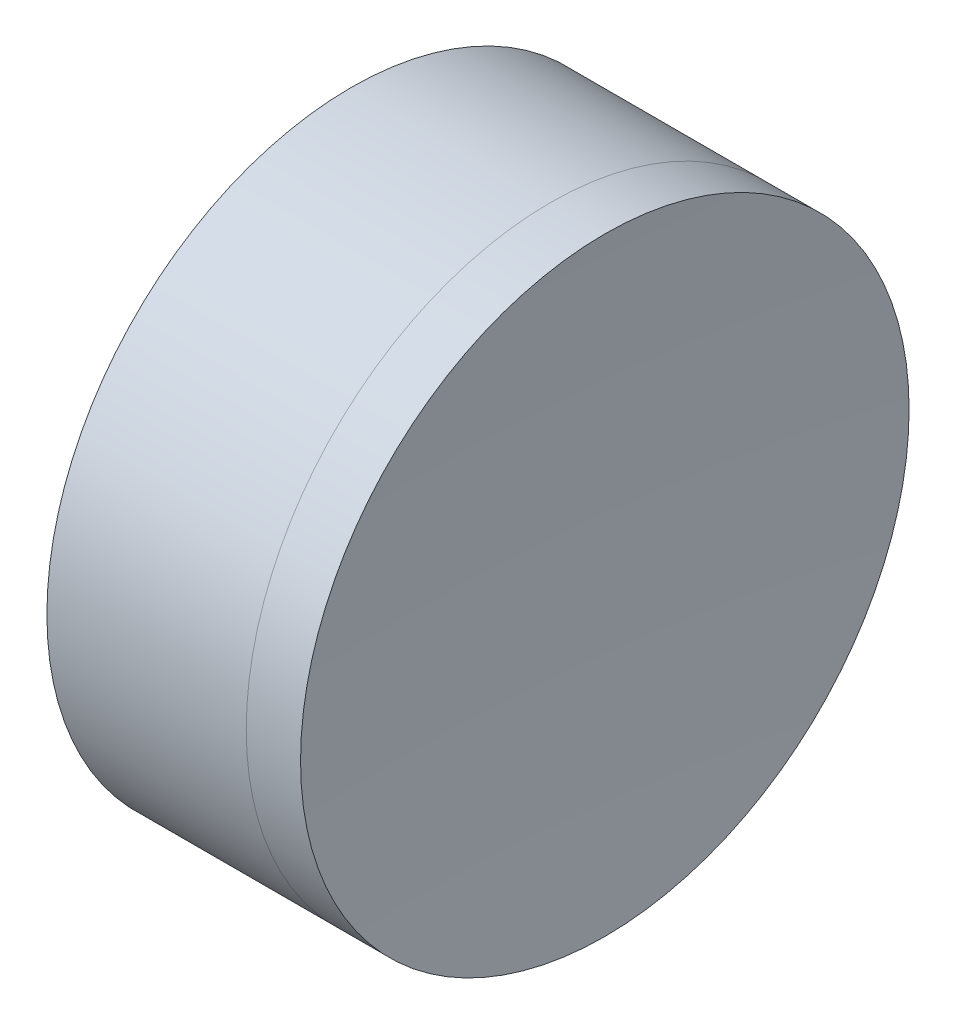
ISO-10303-21;
HEADER;
FILE_DESCRIPTION(('STEP AP214'),'2;1');
FILE_NAME('part.step','',(''),(''),'','','');
FILE_SCHEMA(('AUTOMOTIVE_DESIGN { 1 0 10303 214 1 1 1 1 }'));
ENDSEC;
DATA;
#1=APPLICATION_CONTEXT('core data for automotive mechanical design processes');
#2=APPLICATION_PROTOCOL_DEFINITION('international standard','automotive_design',2000,#1);
#3=PRODUCT_CONTEXT('',#1,'mechanical');
#4=PRODUCT('Part','Part','',(#3));
#5=PRODUCT_RELATED_PRODUCT_CATEGORY('part','',(#4));
#6=PRODUCT_DEFINITION_FORMATION('','',#4);
#7=PRODUCT_DEFINITION_CONTEXT('part definition',#1,'design');
#8=PRODUCT_DEFINITION('design','',#6,#7);
#9=PRODUCT_DEFINITION_SHAPE('','',#8);
#10=(LENGTH_UNIT() NAMED_UNIT(*) SI_UNIT(.MILLI.,.METRE.));
#11=(NAMED_UNIT(*) PLANE_ANGLE_UNIT() SI_UNIT($,.RADIAN.));
#12=(NAMED_UNIT(*) SI_UNIT($,.STERADIAN.) SOLID_ANGLE_UNIT());
#13=UNCERTAINTY_MEASURE_WITH_UNIT(LENGTH_MEASURE(1.E-05),#10,'distance_accuracy_value','');
#14=(GEOMETRIC_REPRESENTATION_CONTEXT(3) GLOBAL_UNCERTAINTY_ASSIGNED_CONTEXT((#13)) GLOBAL_UNIT_ASSIGNED_CONTEXT((#10,
#11,#12)) REPRESENTATION_CONTEXT('',''));
#15=CARTESIAN_POINT('',(0.,0.,0.));
#16=DIRECTION('',(0.,0.,1.));
#17=DIRECTION('',(1.,0.,0.));
#18=AXIS2_PLACEMENT_3D('',#15,#16,#17);
#19=CARTESIAN_POINT('',(289.383391755373,0.,0.));
#20=DIRECTION('',(-1.,0.,0.));
#21=DIRECTION('',(0.,0.,1.));
#22=AXIS2_PLACEMENT_3D('',#19,#20,#21);
#23=SPHERICAL_SURFACE('',#22,27.1);
#24=CARTESIAN_POINT('',(265.443466943461,0.,0.));
#25=DIRECTION('',(-1.,0.,0.));
#26=DIRECTION('',(0.,0.,1.));
#27=AXIS2_PLACEMENT_3D('',#24,#25,#26);
#28=CIRCLE('',#27,12.7);
#29=CARTESIAN_POINT('',(265.443466943461,0.,12.7));
#30=VERTEX_POINT('',#29);
#31=EDGE_CURVE('E11',#30,#30,#28,.T.);
#32=ORIENTED_EDGE('',*,*,#31,.T.);
#33=EDGE_LOOP('',(#32));
#34=FACE_BOUND('',#33,.T.);
#35=ADVANCED_FACE('F45',(#34),#23,.T.);
#36=CARTESIAN_POINT('',(257.123316567284,0.,0.));
#37=DIRECTION('',(-1.,0.,0.));
#38=DIRECTION('',(0.,0.,1.));
#39=AXIS2_PLACEMENT_3D('',#36,#37,#38);
#40=CYLINDRICAL_SURFACE('',#39,12.7);
#41=CARTESIAN_POINT('',(267.710115044923,0.,0.));
#42=DIRECTION('',(-1.,0.,0.));
#43=DIRECTION('',(0.,0.,1.));
#44=AXIS2_PLACEMENT_3D('',#41,#42,#43);
#45=CIRCLE('',#44,12.7);
#46=CARTESIAN_POINT('',(267.710115044923,0.,12.7));
#47=VERTEX_POINT('',#46);
#48=EDGE_CURVE('E51',#47,#47,#45,.T.);
#49=ORIENTED_EDGE('',*,*,#48,.T.);
#50=EDGE_LOOP('',(#49));
#51=FACE_BOUND('',#50,.T.);
#52=ORIENTED_EDGE('',*,*,#31,.F.);
#53=EDGE_LOOP('',(#52));
#54=FACE_BOUND('',#53,.T.);
#55=ADVANCED_FACE('F57',(#51,#54),#40,.T.);
#56=CARTESIAN_POINT('',(456.483391755373,0.,0.));
#57=DIRECTION('',(-1.,0.,0.));
#58=DIRECTION('',(0.,0.,1.));
#59=AXIS2_PLACEMENT_3D('',#56,#57,#58);
#60=SPHERICAL_SURFACE('',#59,189.2);
#61=ORIENTED_EDGE('',*,*,#48,.F.);
#62=EDGE_LOOP('',(#61));
#63=FACE_BOUND('',#62,.T.);
#64=ADVANCED_FACE('F60',(#63),#60,.F.);
#65=CLOSED_SHELL('',(#35,#55,#64));
#66=MANIFOLD_SOLID_BREP('B2',#65);
#67=CARTESIAN_POINT('',(233.183391755372,0.,0.));
#68=DIRECTION('',(-1.,0.,0.));
#69=DIRECTION('',(0.,0.,1.));
#70=AXIS2_PLACEMENT_3D('',#67,#68,#69);
#71=SPHERICAL_SURFACE('',#70,27.1);
#72=CARTESIAN_POINT('',(257.123316567284,0.,0.));
#73=DIRECTION('',(-1.,0.,0.));
#74=DIRECTION('',(0.,0.,1.));
#75=AXIS2_PLACEMENT_3D('',#72,#73,#74);
#76=CIRCLE('',#75,12.7);
#77=CARTESIAN_POINT('',(257.123316567284,0.,12.7));
#78=VERTEX_POINT('',#77);
#79=EDGE_CURVE('E44',#78,#78,#76,.T.);
#80=ORIENTED_EDGE('',*,*,#79,.T.);
#81=EDGE_LOOP('',(#80));
#82=FACE_BOUND('',#81,.T.);
#83=ADVANCED_FACE('F86',(#82),#71,.F.);
#84=CARTESIAN_POINT('',(-0.816062176165804,0.,0.));
#85=DIRECTION('',(-1.,0.,0.));
#86=DIRECTION('',(0.,0.,1.));
#87=AXIS2_PLACEMENT_3D('',#84,#85,#86);
#88=CYLINDRICAL_SURFACE('',#87,12.7);
#89=CARTESIAN_POINT('',(265.443466943461,0.,0.));
#90=DIRECTION('',(-1.,0.,0.));
#91=DIRECTION('',(0.,0.,1.));
#92=AXIS2_PLACEMENT_3D('',#89,#90,#91);
#93=CIRCLE('',#92,12.7);
#94=CARTESIAN_POINT('',(265.443466943461,0.,12.7));
#95=VERTEX_POINT('',#94);
#96=EDGE_CURVE('E92',#95,#95,#93,.T.);
#97=ORIENTED_EDGE('',*,*,#96,.T.);
#98=EDGE_LOOP('',(#97));
#99=FACE_BOUND('',#98,.T.);
#100=ORIENTED_EDGE('',*,*,#79,.F.);
#101=EDGE_LOOP('',(#100));
#102=FACE_BOUND('',#101,.T.);
#103=ADVANCED_FACE('F98',(#99,#102),#88,.T.);
#104=CARTESIAN_POINT('',(289.383391755373,0.,0.));
#105=DIRECTION('',(-1.,0.,0.));
#106=DIRECTION('',(0.,0.,-1.));
#107=AXIS2_PLACEMENT_3D('',#104,#105,#106);
#108=SPHERICAL_SURFACE('',#107,27.1);
#109=ORIENTED_EDGE('',*,*,#96,.F.);
#110=EDGE_LOOP('',(#109));
#111=FACE_BOUND('',#110,.T.);
#112=ADVANCED_FACE('F101',(#111),#108,.F.);
#113=CLOSED_SHELL('',(#83,#103,#112));
#114=MANIFOLD_SOLID_BREP('B6',#113);
#115=ADVANCED_BREP_SHAPE_REPRESENTATION('',(#18,#66,#114),#14);
#116=SHAPE_DEFINITION_REPRESENTATION(#9,#115);
ENDSEC;
END-ISO-10303-21;
